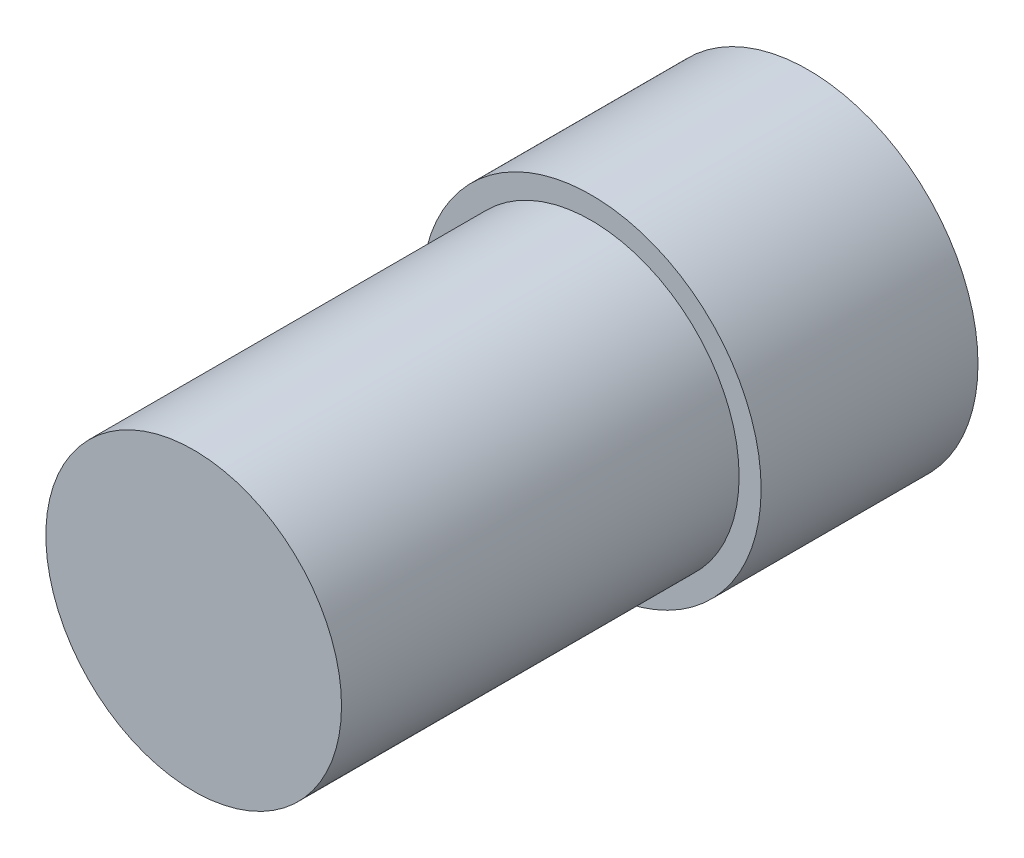
ISO-10303-21;
HEADER;
FILE_DESCRIPTION(('STEP AP214'),'2;1');
FILE_NAME('part.step','',(''),(''),'','','');
FILE_SCHEMA(('AUTOMOTIVE_DESIGN { 1 0 10303 214 1 1 1 1 }'));
ENDSEC;
DATA;
#1=APPLICATION_CONTEXT('core data for automotive mechanical design processes');
#2=APPLICATION_PROTOCOL_DEFINITION('international standard','automotive_design',2000,#1);
#3=PRODUCT_CONTEXT('',#1,'mechanical');
#4=PRODUCT('Part','Part','',(#3));
#5=PRODUCT_RELATED_PRODUCT_CATEGORY('part','',(#4));
#6=PRODUCT_DEFINITION_FORMATION('','',#4);
#7=PRODUCT_DEFINITION_CONTEXT('part definition',#1,'design');
#8=PRODUCT_DEFINITION('design','',#6,#7);
#9=PRODUCT_DEFINITION_SHAPE('','',#8);
#10=(LENGTH_UNIT() NAMED_UNIT(*) SI_UNIT(.MILLI.,.METRE.));
#11=(NAMED_UNIT(*) PLANE_ANGLE_UNIT() SI_UNIT($,.RADIAN.));
#12=(NAMED_UNIT(*) SI_UNIT($,.STERADIAN.) SOLID_ANGLE_UNIT());
#13=UNCERTAINTY_MEASURE_WITH_UNIT(LENGTH_MEASURE(1.E-05),#10,'distance_accuracy_value','');
#14=(GEOMETRIC_REPRESENTATION_CONTEXT(3) GLOBAL_UNCERTAINTY_ASSIGNED_CONTEXT((#13)) GLOBAL_UNIT_ASSIGNED_CONTEXT((#10,
#11,#12)) REPRESENTATION_CONTEXT('',''));
#15=CARTESIAN_POINT('',(0.,0.,0.));
#16=DIRECTION('',(0.,0.,1.));
#17=DIRECTION('',(1.,0.,0.));
#18=AXIS2_PLACEMENT_3D('',#15,#16,#17);
#19=CARTESIAN_POINT('',(0.,0.,6.));
#20=DIRECTION('',(0.,0.,-1.));
#21=DIRECTION('',(-1.,0.,0.));
#22=AXIS2_PLACEMENT_3D('',#19,#20,#21);
#23=CYLINDRICAL_SURFACE('',#22,4.699);
#24=CARTESIAN_POINT('',(0.,0.,6.));
#25=DIRECTION('',(0.,0.,1.));
#26=DIRECTION('',(1.,0.,0.));
#27=AXIS2_PLACEMENT_3D('',#24,#25,#26);
#28=CIRCLE('',#27,4.699);
#29=CARTESIAN_POINT('',(4.699,0.,6.));
#30=VERTEX_POINT('',#29);
#31=EDGE_CURVE('E45',#30,#30,#28,.T.);
#32=ORIENTED_EDGE('',*,*,#31,.F.);
#33=EDGE_LOOP('',(#32));
#34=FACE_BOUND('',#33,.T.);
#35=CARTESIAN_POINT('',(0.,0.,0.));
#36=DIRECTION('',(0.,0.,1.));
#37=DIRECTION('',(1.,0.,0.));
#38=AXIS2_PLACEMENT_3D('',#35,#36,#37);
#39=CIRCLE('',#38,4.699);
#40=CARTESIAN_POINT('',(4.699,0.,0.));
#41=VERTEX_POINT('',#40);
#42=EDGE_CURVE('E40',#41,#41,#39,.T.);
#43=ORIENTED_EDGE('',*,*,#42,.T.);
#44=EDGE_LOOP('',(#43));
#45=FACE_BOUND('',#44,.T.);
#46=ADVANCED_FACE('F37',(#34,#45),#23,.T.);
#47=CARTESIAN_POINT('',(0.,0.,6.));
#48=DIRECTION('',(0.,0.,1.));
#49=DIRECTION('',(1.,0.,0.));
#50=AXIS2_PLACEMENT_3D('',#47,#48,#49);
#51=PLANE('',#50);
#52=CARTESIAN_POINT('',(0.,0.,6.));
#53=DIRECTION('',(0.,0.,1.));
#54=DIRECTION('',(1.,0.,0.));
#55=AXIS2_PLACEMENT_3D('',#52,#53,#54);
#56=CIRCLE('',#55,4.09);
#57=CARTESIAN_POINT('',(4.09,0.,6.));
#58=VERTEX_POINT('',#57);
#59=EDGE_CURVE('E10',#58,#58,#56,.T.);
#60=ORIENTED_EDGE('',*,*,#59,.F.);
#61=EDGE_LOOP('',(#60));
#62=FACE_BOUND('',#61,.T.);
#63=ORIENTED_EDGE('',*,*,#31,.T.);
#64=EDGE_LOOP('',(#63));
#65=FACE_BOUND('',#64,.T.);
#66=ADVANCED_FACE('F65',(#62,#65),#51,.T.);
#67=CARTESIAN_POINT('',(0.,0.,0.));
#68=DIRECTION('',(0.,0.,1.));
#69=DIRECTION('',(1.,0.,0.));
#70=AXIS2_PLACEMENT_3D('',#67,#68,#69);
#71=PLANE('',#70);
#72=ORIENTED_EDGE('',*,*,#42,.F.);
#73=EDGE_LOOP('',(#72));
#74=FACE_BOUND('',#73,.T.);
#75=ADVANCED_FACE('F62',(#74),#71,.F.);
#76=CARTESIAN_POINT('',(0.,0.,17.));
#77=DIRECTION('',(0.,0.,-1.));
#78=DIRECTION('',(-1.,0.,0.));
#79=AXIS2_PLACEMENT_3D('',#76,#77,#78);
#80=CYLINDRICAL_SURFACE('',#79,4.09);
#81=CARTESIAN_POINT('',(0.,0.,17.));
#82=DIRECTION('',(0.,0.,1.));
#83=DIRECTION('',(1.,0.,0.));
#84=AXIS2_PLACEMENT_3D('',#81,#82,#83);
#85=CIRCLE('',#84,4.09);
#86=CARTESIAN_POINT('',(4.09,0.,17.));
#87=VERTEX_POINT('',#86);
#88=EDGE_CURVE('E52',#87,#87,#85,.T.);
#89=ORIENTED_EDGE('',*,*,#88,.F.);
#90=EDGE_LOOP('',(#89));
#91=FACE_BOUND('',#90,.T.);
#92=ORIENTED_EDGE('',*,*,#59,.T.);
#93=EDGE_LOOP('',(#92));
#94=FACE_BOUND('',#93,.T.);
#95=ADVANCED_FACE('F64',(#91,#94),#80,.T.);
#96=CARTESIAN_POINT('',(0.,0.,17.));
#97=DIRECTION('',(0.,0.,1.));
#98=DIRECTION('',(1.,0.,0.));
#99=AXIS2_PLACEMENT_3D('',#96,#97,#98);
#100=PLANE('',#99);
#101=ORIENTED_EDGE('',*,*,#88,.T.);
#102=EDGE_LOOP('',(#101));
#103=FACE_BOUND('',#102,.T.);
#104=ADVANCED_FACE('F70',(#103),#100,.T.);
#105=CLOSED_SHELL('',(#46,#66,#75,#95,#104));
#106=MANIFOLD_SOLID_BREP('B2',#105);
#107=ADVANCED_BREP_SHAPE_REPRESENTATION('',(#18,#106),#14);
#108=SHAPE_DEFINITION_REPRESENTATION(#9,#107);
ENDSEC;
END-ISO-10303-21;
